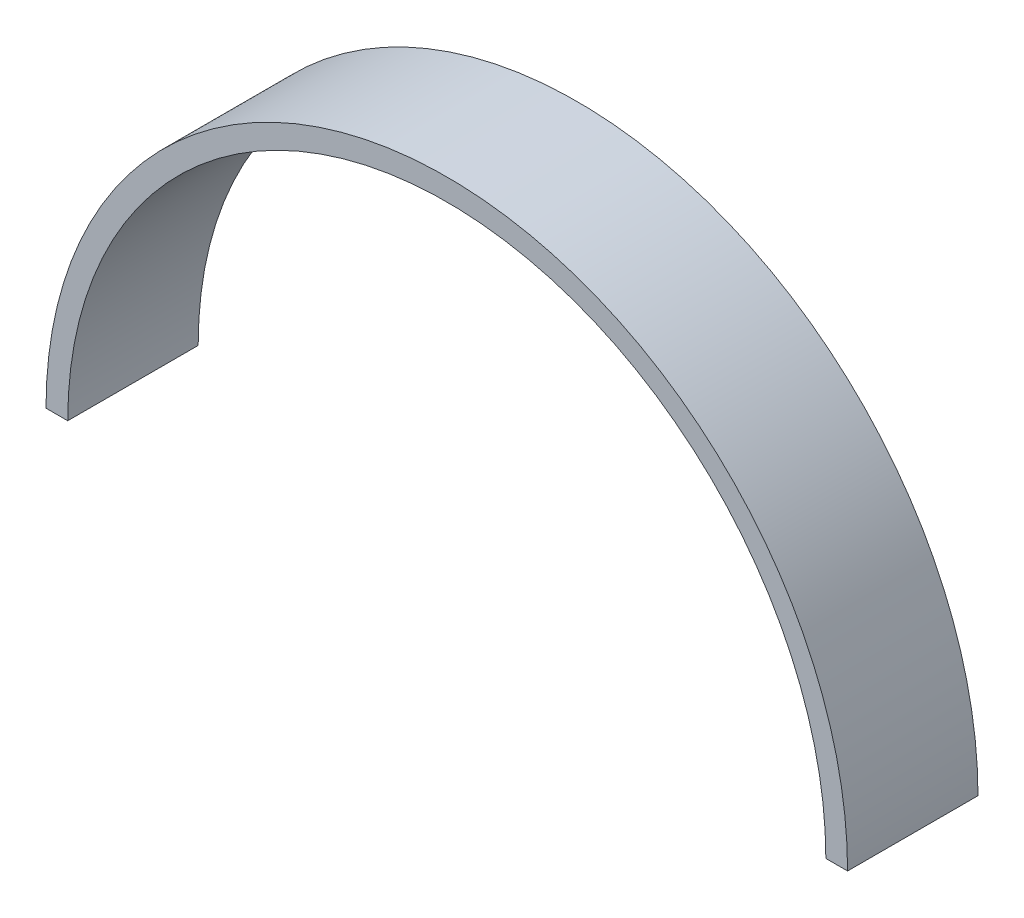
ISO-10303-21;
HEADER;
FILE_DESCRIPTION(('STEP AP214'),'2;1');
FILE_NAME('part.step','',(''),(''),'','','');
FILE_SCHEMA(('AUTOMOTIVE_DESIGN { 1 0 10303 214 1 1 1 1 }'));
ENDSEC;
DATA;
#1=APPLICATION_CONTEXT('core data for automotive mechanical design processes');
#2=APPLICATION_PROTOCOL_DEFINITION('international standard','automotive_design',2000,#1);
#3=PRODUCT_CONTEXT('',#1,'mechanical');
#4=PRODUCT('Part','Part','',(#3));
#5=PRODUCT_RELATED_PRODUCT_CATEGORY('part','',(#4));
#6=PRODUCT_DEFINITION_FORMATION('','',#4);
#7=PRODUCT_DEFINITION_CONTEXT('part definition',#1,'design');
#8=PRODUCT_DEFINITION('design','',#6,#7);
#9=PRODUCT_DEFINITION_SHAPE('','',#8);
#10=(LENGTH_UNIT() NAMED_UNIT(*) SI_UNIT(.MILLI.,.METRE.));
#11=(NAMED_UNIT(*) PLANE_ANGLE_UNIT() SI_UNIT($,.RADIAN.));
#12=(NAMED_UNIT(*) SI_UNIT($,.STERADIAN.) SOLID_ANGLE_UNIT());
#13=UNCERTAINTY_MEASURE_WITH_UNIT(LENGTH_MEASURE(1.E-05),#10,'distance_accuracy_value','');
#14=(GEOMETRIC_REPRESENTATION_CONTEXT(3) GLOBAL_UNCERTAINTY_ASSIGNED_CONTEXT((#13)) GLOBAL_UNIT_ASSIGNED_CONTEXT((#10,
#11,#12)) REPRESENTATION_CONTEXT('',''));
#15=CARTESIAN_POINT('',(0.,0.,0.));
#16=DIRECTION('',(0.,0.,1.));
#17=DIRECTION('',(1.,0.,0.));
#18=AXIS2_PLACEMENT_3D('',#15,#16,#17);
#19=CARTESIAN_POINT('',(0.,0.,19.05));
#20=DIRECTION('',(0.,0.,-1.));
#21=DIRECTION('',(-1.,0.,0.));
#22=AXIS2_PLACEMENT_3D('',#19,#20,#21);
#23=CYLINDRICAL_SURFACE('',#22,58.545);
#24=CARTESIAN_POINT('',(0.,0.,0.));
#25=DIRECTION('',(0.,0.,1.));
#26=DIRECTION('',(-1.,0.,0.));
#27=AXIS2_PLACEMENT_3D('',#24,#25,#26);
#28=CIRCLE('',#27,58.545);
#29=CARTESIAN_POINT('',(58.545,0.,0.));
#30=VERTEX_POINT('',#29);
#31=CARTESIAN_POINT('',(-58.545,0.,0.));
#32=VERTEX_POINT('',#31);
#33=EDGE_CURVE('E107',#30,#32,#28,.T.);
#34=ORIENTED_EDGE('',*,*,#33,.T.);
#35=DIRECTION('',(0.,0.,-1.));
#36=VECTOR('',#35,1.);
#37=CARTESIAN_POINT('',(-58.545,0.,19.05));
#38=LINE('',#37,#36);
#39=CARTESIAN_POINT('',(-58.545,0.,19.05));
#40=VERTEX_POINT('',#39);
#41=EDGE_CURVE('E11',#40,#32,#38,.T.);
#42=ORIENTED_EDGE('',*,*,#41,.F.);
#43=CARTESIAN_POINT('',(0.,0.,19.05));
#44=DIRECTION('',(0.,0.,1.));
#45=DIRECTION('',(-1.,0.,0.));
#46=AXIS2_PLACEMENT_3D('',#43,#44,#45);
#47=CIRCLE('',#46,58.545);
#48=CARTESIAN_POINT('',(58.545,0.,19.05));
#49=VERTEX_POINT('',#48);
#50=EDGE_CURVE('E91',#49,#40,#47,.T.);
#51=ORIENTED_EDGE('',*,*,#50,.F.);
#52=DIRECTION('',(0.,0.,-1.));
#53=VECTOR('',#52,1.);
#54=CARTESIAN_POINT('',(58.545,0.,19.05));
#55=LINE('',#54,#53);
#56=EDGE_CURVE('E103',#49,#30,#55,.T.);
#57=ORIENTED_EDGE('',*,*,#56,.T.);
#58=EDGE_LOOP('',(#34,#42,#51,#57));
#59=FACE_BOUND('',#58,.T.);
#60=ADVANCED_FACE('F39',(#59),#23,.T.);
#61=CARTESIAN_POINT('',(-58.545,0.,19.05));
#62=DIRECTION('',(0.,1.,0.));
#63=DIRECTION('',(0.,0.,1.));
#64=AXIS2_PLACEMENT_3D('',#61,#62,#63);
#65=PLANE('',#64);
#66=DIRECTION('',(1.,0.,0.));
#67=VECTOR('',#66,1.);
#68=CARTESIAN_POINT('',(-58.545,0.,0.));
#69=LINE('',#68,#67);
#70=CARTESIAN_POINT('',(-55.37,0.,0.));
#71=VERTEX_POINT('',#70);
#72=EDGE_CURVE('E96',#32,#71,#69,.T.);
#73=ORIENTED_EDGE('',*,*,#72,.T.);
#74=DIRECTION('',(0.,0.,-1.));
#75=VECTOR('',#74,1.);
#76=CARTESIAN_POINT('',(-55.37,0.,19.05));
#77=LINE('',#76,#75);
#78=CARTESIAN_POINT('',(-55.37,0.,19.05));
#79=VERTEX_POINT('',#78);
#80=EDGE_CURVE('E48',#79,#71,#77,.T.);
#81=ORIENTED_EDGE('',*,*,#80,.F.);
#82=DIRECTION('',(1.,0.,0.));
#83=VECTOR('',#82,1.);
#84=CARTESIAN_POINT('',(-58.545,0.,19.05));
#85=LINE('',#84,#83);
#86=EDGE_CURVE('E86',#40,#79,#85,.T.);
#87=ORIENTED_EDGE('',*,*,#86,.F.);
#88=ORIENTED_EDGE('',*,*,#41,.T.);
#89=EDGE_LOOP('',(#73,#81,#87,#88));
#90=FACE_BOUND('',#89,.T.);
#91=ADVANCED_FACE('F95',(#90),#65,.F.);
#92=CARTESIAN_POINT('',(0.,0.,19.05));
#93=DIRECTION('',(0.,0.,-1.));
#94=DIRECTION('',(-1.,0.,0.));
#95=AXIS2_PLACEMENT_3D('',#92,#93,#94);
#96=CYLINDRICAL_SURFACE('',#95,55.37);
#97=CARTESIAN_POINT('',(0.,0.,0.));
#98=DIRECTION('',(0.,0.,-1.));
#99=DIRECTION('',(-1.,0.,0.));
#100=AXIS2_PLACEMENT_3D('',#97,#98,#99);
#101=CIRCLE('',#100,55.37);
#102=CARTESIAN_POINT('',(55.37,0.,0.));
#103=VERTEX_POINT('',#102);
#104=EDGE_CURVE('E73',#71,#103,#101,.T.);
#105=ORIENTED_EDGE('',*,*,#104,.T.);
#106=DIRECTION('',(0.,0.,-1.));
#107=VECTOR('',#106,1.);
#108=CARTESIAN_POINT('',(55.37,0.,19.05));
#109=LINE('',#108,#107);
#110=CARTESIAN_POINT('',(55.37,0.,19.05));
#111=VERTEX_POINT('',#110);
#112=EDGE_CURVE('E98',#111,#103,#109,.T.);
#113=ORIENTED_EDGE('',*,*,#112,.F.);
#114=CARTESIAN_POINT('',(0.,0.,19.05));
#115=DIRECTION('',(0.,0.,-1.));
#116=DIRECTION('',(-1.,0.,0.));
#117=AXIS2_PLACEMENT_3D('',#114,#115,#116);
#118=CIRCLE('',#117,55.37);
#119=EDGE_CURVE('E89',#79,#111,#118,.T.);
#120=ORIENTED_EDGE('',*,*,#119,.F.);
#121=ORIENTED_EDGE('',*,*,#80,.T.);
#122=EDGE_LOOP('',(#105,#113,#120,#121));
#123=FACE_BOUND('',#122,.T.);
#124=ADVANCED_FACE('F99',(#123),#96,.F.);
#125=CARTESIAN_POINT('',(55.37,0.,19.05));
#126=DIRECTION('',(0.,1.,0.));
#127=DIRECTION('',(0.,0.,1.));
#128=AXIS2_PLACEMENT_3D('',#125,#126,#127);
#129=PLANE('',#128);
#130=DIRECTION('',(1.,0.,0.));
#131=VECTOR('',#130,1.);
#132=CARTESIAN_POINT('',(55.37,0.,0.));
#133=LINE('',#132,#131);
#134=EDGE_CURVE('E79',#103,#30,#133,.T.);
#135=ORIENTED_EDGE('',*,*,#134,.T.);
#136=ORIENTED_EDGE('',*,*,#56,.F.);
#137=DIRECTION('',(1.,0.,0.));
#138=VECTOR('',#137,1.);
#139=CARTESIAN_POINT('',(55.37,0.,19.05));
#140=LINE('',#139,#138);
#141=EDGE_CURVE('E56',#111,#49,#140,.T.);
#142=ORIENTED_EDGE('',*,*,#141,.F.);
#143=ORIENTED_EDGE('',*,*,#112,.T.);
#144=EDGE_LOOP('',(#135,#136,#142,#143));
#145=FACE_BOUND('',#144,.T.);
#146=ADVANCED_FACE('F120',(#145),#129,.F.);
#147=CARTESIAN_POINT('',(0.,0.,19.05));
#148=DIRECTION('',(0.,0.,-1.));
#149=DIRECTION('',(-1.,0.,0.));
#150=AXIS2_PLACEMENT_3D('',#147,#148,#149);
#151=PLANE('',#150);
#152=ORIENTED_EDGE('',*,*,#50,.T.);
#153=ORIENTED_EDGE('',*,*,#86,.T.);
#154=ORIENTED_EDGE('',*,*,#119,.T.);
#155=ORIENTED_EDGE('',*,*,#141,.T.);
#156=EDGE_LOOP('',(#152,#153,#154,#155));
#157=FACE_BOUND('',#156,.T.);
#158=ADVANCED_FACE('F87',(#157),#151,.F.);
#159=CARTESIAN_POINT('',(0.,0.,0.));
#160=DIRECTION('',(0.,0.,-1.));
#161=DIRECTION('',(-1.,0.,0.));
#162=AXIS2_PLACEMENT_3D('',#159,#160,#161);
#163=PLANE('',#162);
#164=ORIENTED_EDGE('',*,*,#33,.F.);
#165=ORIENTED_EDGE('',*,*,#134,.F.);
#166=ORIENTED_EDGE('',*,*,#104,.F.);
#167=ORIENTED_EDGE('',*,*,#72,.F.);
#168=EDGE_LOOP('',(#164,#165,#166,#167));
#169=FACE_BOUND('',#168,.T.);
#170=ADVANCED_FACE('F123',(#169),#163,.T.);
#171=CLOSED_SHELL('',(#60,#91,#124,#146,#158,#170));
#172=MANIFOLD_SOLID_BREP('B2',#171);
#173=ADVANCED_BREP_SHAPE_REPRESENTATION('',(#18,#172),#14);
#174=SHAPE_DEFINITION_REPRESENTATION(#9,#173);
ENDSEC;
END-ISO-10303-21;
